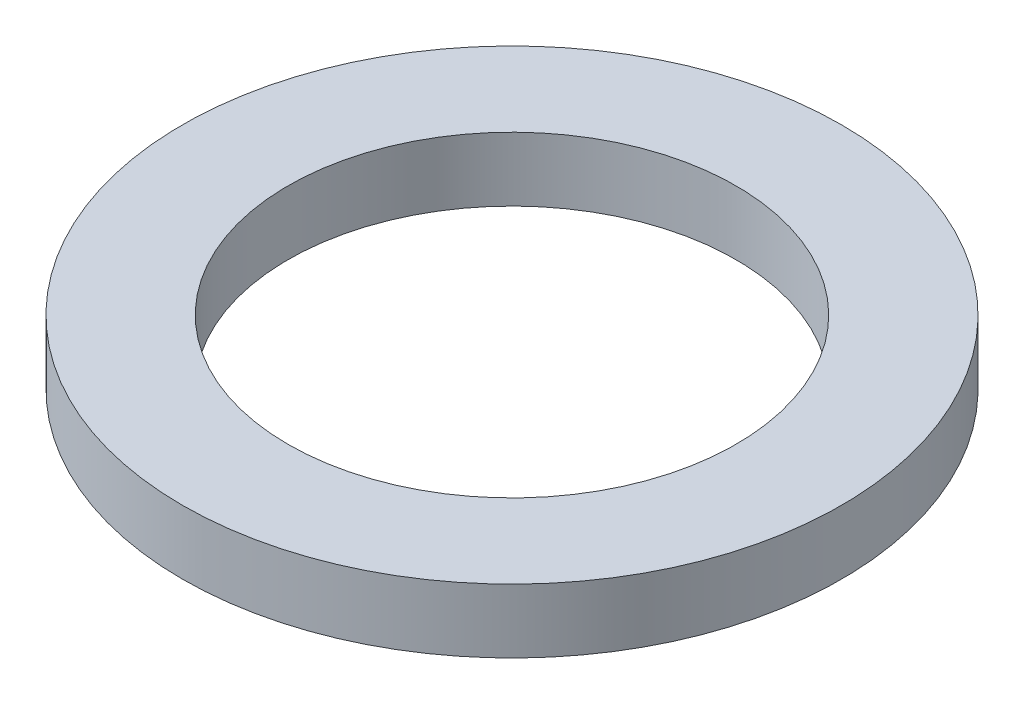
ISO-10303-21;
HEADER;
FILE_DESCRIPTION(('STEP AP214'),'2;1');
FILE_NAME('part.step','',(''),(''),'','','');
FILE_SCHEMA(('AUTOMOTIVE_DESIGN { 1 0 10303 214 1 1 1 1 }'));
ENDSEC;
DATA;
#1=APPLICATION_CONTEXT('core data for automotive mechanical design processes');
#2=APPLICATION_PROTOCOL_DEFINITION('international standard','automotive_design',2000,#1);
#3=PRODUCT_CONTEXT('',#1,'mechanical');
#4=PRODUCT('Part','Part','',(#3));
#5=PRODUCT_RELATED_PRODUCT_CATEGORY('part','',(#4));
#6=PRODUCT_DEFINITION_FORMATION('','',#4);
#7=PRODUCT_DEFINITION_CONTEXT('part definition',#1,'design');
#8=PRODUCT_DEFINITION('design','',#6,#7);
#9=PRODUCT_DEFINITION_SHAPE('','',#8);
#10=(LENGTH_UNIT() NAMED_UNIT(*) SI_UNIT(.MILLI.,.METRE.));
#11=(NAMED_UNIT(*) PLANE_ANGLE_UNIT() SI_UNIT($,.RADIAN.));
#12=(NAMED_UNIT(*) SI_UNIT($,.STERADIAN.) SOLID_ANGLE_UNIT());
#13=UNCERTAINTY_MEASURE_WITH_UNIT(LENGTH_MEASURE(1.E-05),#10,'distance_accuracy_value','');
#14=(GEOMETRIC_REPRESENTATION_CONTEXT(3) GLOBAL_UNCERTAINTY_ASSIGNED_CONTEXT((#13)) GLOBAL_UNIT_ASSIGNED_CONTEXT((#10,
#11,#12)) REPRESENTATION_CONTEXT('',''));
#15=CARTESIAN_POINT('',(0.,0.,0.));
#16=DIRECTION('',(0.,0.,1.));
#17=DIRECTION('',(1.,0.,0.));
#18=AXIS2_PLACEMENT_3D('',#15,#16,#17);
#19=CARTESIAN_POINT('',(0.,2.,0.));
#20=DIRECTION('',(0.,1.,0.));
#21=DIRECTION('',(0.,0.,1.));
#22=AXIS2_PLACEMENT_3D('',#19,#20,#21);
#23=PLANE('',#22);
#24=CARTESIAN_POINT('',(0.,2.,0.));
#25=DIRECTION('',(0.,1.,0.));
#26=DIRECTION('',(0.,0.,1.));
#27=AXIS2_PLACEMENT_3D('',#24,#25,#26);
#28=CIRCLE('',#27,10.3);
#29=CARTESIAN_POINT('',(0.,2.,10.3));
#30=VERTEX_POINT('',#29);
#31=EDGE_CURVE('E10',#30,#30,#28,.T.);
#32=ORIENTED_EDGE('',*,*,#31,.T.);
#33=EDGE_LOOP('',(#32));
#34=FACE_BOUND('',#33,.T.);
#35=CARTESIAN_POINT('',(0.,2.,0.));
#36=DIRECTION('',(0.,1.,0.));
#37=DIRECTION('',(0.,0.,1.));
#38=AXIS2_PLACEMENT_3D('',#35,#36,#37);
#39=CIRCLE('',#38,7.);
#40=CARTESIAN_POINT('',(0.,2.,7.));
#41=VERTEX_POINT('',#40);
#42=EDGE_CURVE('E43',#41,#41,#39,.T.);
#43=ORIENTED_EDGE('',*,*,#42,.F.);
#44=EDGE_LOOP('',(#43));
#45=FACE_BOUND('',#44,.T.);
#46=ADVANCED_FACE('F32',(#34,#45),#23,.T.);
#47=CARTESIAN_POINT('',(0.,0.,0.));
#48=DIRECTION('',(0.,1.,0.));
#49=DIRECTION('',(0.,0.,1.));
#50=AXIS2_PLACEMENT_3D('',#47,#48,#49);
#51=PLANE('',#50);
#52=CARTESIAN_POINT('',(0.,0.,0.));
#53=DIRECTION('',(0.,1.,0.));
#54=DIRECTION('',(0.,0.,1.));
#55=AXIS2_PLACEMENT_3D('',#52,#53,#54);
#56=CIRCLE('',#55,10.3);
#57=CARTESIAN_POINT('',(0.,0.,10.3));
#58=VERTEX_POINT('',#57);
#59=EDGE_CURVE('E36',#58,#58,#56,.T.);
#60=ORIENTED_EDGE('',*,*,#59,.F.);
#61=EDGE_LOOP('',(#60));
#62=FACE_BOUND('',#61,.T.);
#63=CARTESIAN_POINT('',(0.,0.,0.));
#64=DIRECTION('',(0.,1.,0.));
#65=DIRECTION('',(0.,0.,1.));
#66=AXIS2_PLACEMENT_3D('',#63,#64,#65);
#67=CIRCLE('',#66,7.);
#68=CARTESIAN_POINT('',(0.,0.,7.));
#69=VERTEX_POINT('',#68);
#70=EDGE_CURVE('E45',#69,#69,#67,.T.);
#71=ORIENTED_EDGE('',*,*,#70,.T.);
#72=EDGE_LOOP('',(#71));
#73=FACE_BOUND('',#72,.T.);
#74=ADVANCED_FACE('F55',(#62,#73),#51,.F.);
#75=CARTESIAN_POINT('',(0.,2.,0.));
#76=DIRECTION('',(0.,-1.,0.));
#77=DIRECTION('',(0.,0.,-1.));
#78=AXIS2_PLACEMENT_3D('',#75,#76,#77);
#79=CYLINDRICAL_SURFACE('',#78,10.3);
#80=ORIENTED_EDGE('',*,*,#31,.F.);
#81=EDGE_LOOP('',(#80));
#82=FACE_BOUND('',#81,.T.);
#83=ORIENTED_EDGE('',*,*,#59,.T.);
#84=EDGE_LOOP('',(#83));
#85=FACE_BOUND('',#84,.T.);
#86=ADVANCED_FACE('F34',(#82,#85),#79,.T.);
#87=CARTESIAN_POINT('',(0.,2.,0.));
#88=DIRECTION('',(0.,-1.,0.));
#89=DIRECTION('',(0.,0.,-1.));
#90=AXIS2_PLACEMENT_3D('',#87,#88,#89);
#91=CYLINDRICAL_SURFACE('',#90,7.);
#92=ORIENTED_EDGE('',*,*,#42,.T.);
#93=EDGE_LOOP('',(#92));
#94=FACE_BOUND('',#93,.T.);
#95=ORIENTED_EDGE('',*,*,#70,.F.);
#96=EDGE_LOOP('',(#95));
#97=FACE_BOUND('',#96,.T.);
#98=ADVANCED_FACE('F51',(#94,#97),#91,.F.);
#99=CLOSED_SHELL('',(#46,#74,#86,#98));
#100=MANIFOLD_SOLID_BREP('B2',#99);
#101=ADVANCED_BREP_SHAPE_REPRESENTATION('',(#18,#100),#14);
#102=SHAPE_DEFINITION_REPRESENTATION(#9,#101);
ENDSEC;
END-ISO-10303-21;
